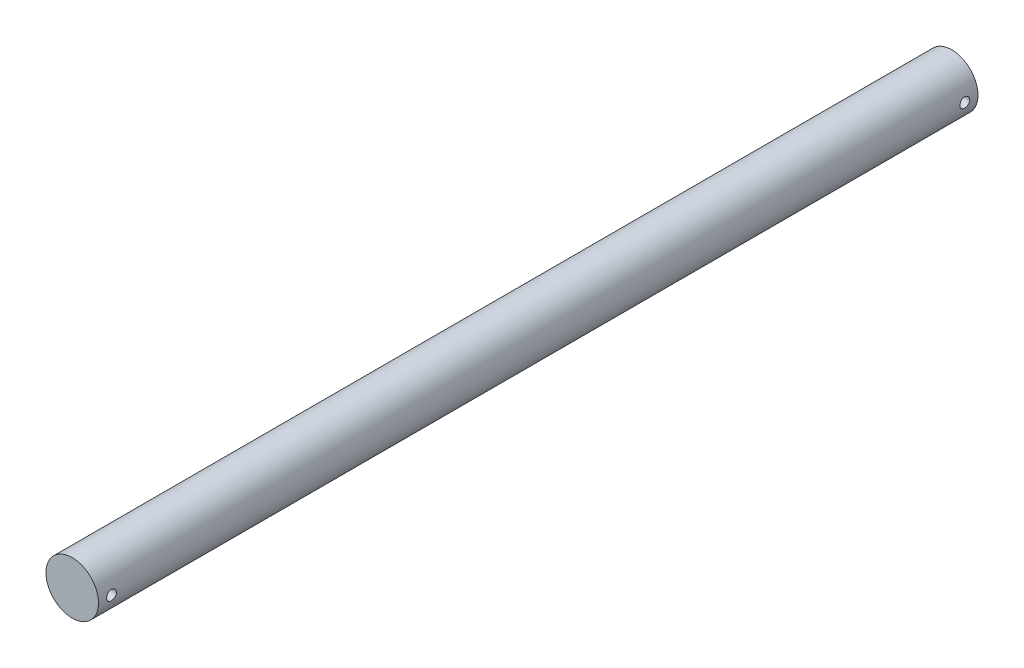
ISO-10303-21;
HEADER;
FILE_DESCRIPTION(('STEP AP214'),'2;1');
FILE_NAME('part.step','',(''),(''),'','','');
FILE_SCHEMA(('AUTOMOTIVE_DESIGN { 1 0 10303 214 1 1 1 1 }'));
ENDSEC;
DATA;
#1=APPLICATION_CONTEXT('core data for automotive mechanical design processes');
#2=APPLICATION_PROTOCOL_DEFINITION('international standard','automotive_design',2000,#1);
#3=PRODUCT_CONTEXT('',#1,'mechanical');
#4=PRODUCT('Part','Part','',(#3));
#5=PRODUCT_RELATED_PRODUCT_CATEGORY('part','',(#4));
#6=PRODUCT_DEFINITION_FORMATION('','',#4);
#7=PRODUCT_DEFINITION_CONTEXT('part definition',#1,'design');
#8=PRODUCT_DEFINITION('design','',#6,#7);
#9=PRODUCT_DEFINITION_SHAPE('','',#8);
#10=(LENGTH_UNIT() NAMED_UNIT(*) SI_UNIT(.MILLI.,.METRE.));
#11=(NAMED_UNIT(*) PLANE_ANGLE_UNIT() SI_UNIT($,.RADIAN.));
#12=(NAMED_UNIT(*) SI_UNIT($,.STERADIAN.) SOLID_ANGLE_UNIT());
#13=UNCERTAINTY_MEASURE_WITH_UNIT(LENGTH_MEASURE(1.E-05),#10,'distance_accuracy_value','');
#14=(GEOMETRIC_REPRESENTATION_CONTEXT(3) GLOBAL_UNCERTAINTY_ASSIGNED_CONTEXT((#13)) GLOBAL_UNIT_ASSIGNED_CONTEXT((#10,
#11,#12)) REPRESENTATION_CONTEXT('',''));
#15=CARTESIAN_POINT('',(0.,0.,0.));
#16=DIRECTION('',(0.,0.,1.));
#17=DIRECTION('',(1.,0.,0.));
#18=AXIS2_PLACEMENT_3D('',#15,#16,#17);
#19=CARTESIAN_POINT('',(0.,0.,50.));
#20=DIRECTION('',(0.,0.,-1.));
#21=DIRECTION('',(-1.,0.,0.));
#22=AXIS2_PLACEMENT_3D('',#19,#20,#21);
#23=CYLINDRICAL_SURFACE('',#22,3.175);
#24=CARTESIAN_POINT('',(-3.175,0.,52.1828125));
#25=CARTESIAN_POINT('',(-3.17499940005935,-0.0331278493784838,52.1828112341322));
#26=CARTESIAN_POINT('',(-3.1744761643768,-0.0662721689897577,52.1800379164667));
#27=CARTESIAN_POINT('',(-3.172439306503,-0.131626820280964,52.1690250644374));
#28=CARTESIAN_POINT('',(-3.17092484847487,-0.163836339741665,52.1607809167774));
#29=CARTESIAN_POINT('',(-3.16707495697541,-0.226366769234935,52.1390877091877));
#30=CARTESIAN_POINT('',(-3.1647402651001,-0.256689356240747,52.1256433498079));
#31=CARTESIAN_POINT('',(-3.15950485144289,-0.314645664321685,52.0939446957213));
#32=CARTESIAN_POINT('',(-3.15660417548509,-0.342279602808189,52.0756907903707));
#33=CARTESIAN_POINT('',(-3.15051811645856,-0.394407912259919,52.0346591545735));
#34=CARTESIAN_POINT('',(-3.14733001333614,-0.418865429028259,52.0118350016465));
#35=CARTESIAN_POINT('',(-3.14104860763277,-0.463627811849747,51.9624106242059));
#36=CARTESIAN_POINT('',(-3.13795531187578,-0.483932379579179,51.9358101286541));
#37=CARTESIAN_POINT('',(-3.13218731275362,-0.519965775954867,51.8793277086806));
#38=CARTESIAN_POINT('',(-3.12951611636078,-0.535657115316872,51.8494214780304));
#39=CARTESIAN_POINT('',(-3.12493308056007,-0.561778643443749,51.7873388992892));
#40=CARTESIAN_POINT('',(-3.12302117566919,-0.572209285923859,51.7551627472434));
#41=CARTESIAN_POINT('',(-3.120200569874,-0.587395056092017,51.6898480177308));
#42=CARTESIAN_POINT('',(-3.11928051754792,-0.592214454824656,51.6567248832974));
#43=CARTESIAN_POINT('',(-3.11851356370002,-0.596240425878407,51.5901283504042));
#44=CARTESIAN_POINT('',(-3.11866656594195,-0.595447501537267,51.5566549836238));
#45=CARTESIAN_POINT('',(-3.12001809916008,-0.588323450296877,51.49077381341));
#46=CARTESIAN_POINT('',(-3.12120283233473,-0.582065407796804,51.4583577821371));
#47=CARTESIAN_POINT('',(-3.12446266491102,-0.564303860103697,51.3950440333988));
#48=CARTESIAN_POINT('',(-3.12653780214714,-0.552800132013012,51.3641463805135));
#49=CARTESIAN_POINT('',(-3.13135905069246,-0.524802287242846,51.3045326180218));
#50=CARTESIAN_POINT('',(-3.13410911079898,-0.508278659956934,51.2758307007382));
#51=CARTESIAN_POINT('',(-3.13996773104908,-0.47073093294259,51.2215793733606));
#52=CARTESIAN_POINT('',(-3.1430763275616,-0.449706376466774,51.1960302836257));
#53=CARTESIAN_POINT('',(-3.1493618800489,-0.403359563188524,51.1483875957175));
#54=CARTESIAN_POINT('',(-3.15253914125162,-0.377974795254081,51.1263548035582));
#55=CARTESIAN_POINT('',(-3.15855900111739,-0.323837314723595,51.086851220107));
#56=CARTESIAN_POINT('',(-3.16140159642488,-0.295084568364007,51.0693804745546));
#57=CARTESIAN_POINT('',(-3.16643757934511,-0.234963886209632,51.0394879539328));
#58=CARTESIAN_POINT('',(-3.16863015282215,-0.2035927333897,51.0270725032876));
#59=CARTESIAN_POINT('',(-3.17211275581704,-0.139159898923854,51.007704481804));
#60=CARTESIAN_POINT('',(-3.17340288121048,-0.106098397260243,51.0007513306445));
#61=CARTESIAN_POINT('',(-3.17492205629786,-0.0397464966210276,50.9925899189396));
#62=CARTESIAN_POINT('',(-3.17516649268311,-0.00646668626416931,50.9912983446116));
#63=CARTESIAN_POINT('',(-3.17460925115547,0.0598333703365878,50.9942732684455));
#64=CARTESIAN_POINT('',(-3.17380762464009,0.0928536292531546,50.998539493529));
#65=CARTESIAN_POINT('',(-3.17125791126724,0.157432999370982,51.0124396483384));
#66=CARTESIAN_POINT('',(-3.16951726067193,0.189001503602659,51.0220314215072));
#67=CARTESIAN_POINT('',(-3.16528387378085,0.250082300755404,51.0462647773778));
#68=CARTESIAN_POINT('',(-3.16279108642311,0.279594453904933,51.0609067029402));
#69=CARTESIAN_POINT('',(-3.15729155798199,0.336080366506809,51.0950091321133));
#70=CARTESIAN_POINT('',(-3.1542794982553,0.363022863065379,51.1145205431068));
#71=CARTESIAN_POINT('',(-3.14808926947479,0.413281147045618,51.1577391982657));
#72=CARTESIAN_POINT('',(-3.14491108492985,0.436596595436344,51.1814468342224));
#73=CARTESIAN_POINT('',(-3.13869576292426,0.479255517992188,51.232762139068));
#74=CARTESIAN_POINT('',(-3.13566105888289,0.498542136242474,51.2604174166623));
#75=CARTESIAN_POINT('',(-3.1301252865148,0.532196179135591,51.3186241822329));
#76=CARTESIAN_POINT('',(-3.12762419835761,0.546563786592762,51.349175562522));
#77=CARTESIAN_POINT('',(-3.12345793983174,0.569891360504018,51.4121629535619));
#78=CARTESIAN_POINT('',(-3.12178874798386,0.57887738552931,51.4445890350126));
#79=CARTESIAN_POINT('',(-3.11946609009083,0.591267071075998,51.5105249914382));
#80=CARTESIAN_POINT('',(-3.1188125094486,0.594671361418124,51.5440347437008));
#81=CARTESIAN_POINT('',(-3.11860088672156,0.595779868526284,51.6106173065409));
#82=CARTESIAN_POINT('',(-3.11902560714798,0.593573770795138,51.6436886024423));
#83=CARTESIAN_POINT('',(-3.12088450886937,0.583720477284626,51.7089800331242));
#84=CARTESIAN_POINT('',(-3.12231868413374,0.576073314010788,51.7412001729884));
#85=CARTESIAN_POINT('',(-3.12602764121699,0.555592803846076,51.8038264361532));
#86=CARTESIAN_POINT('',(-3.12830084823627,0.542769168607846,51.8342358346904));
#87=CARTESIAN_POINT('',(-3.13343285059636,0.512309542245311,51.8924858384018));
#88=CARTESIAN_POINT('',(-3.13629168730422,0.494673211138111,51.9203262619103));
#89=CARTESIAN_POINT('',(-3.14232633736511,0.454777027878779,51.9730972730168));
#90=CARTESIAN_POINT('',(-3.14550625561989,0.432451906336454,51.9979780543626));
#91=CARTESIAN_POINT('',(-3.15179405961498,0.383947958425849,52.0436701738531));
#92=CARTESIAN_POINT('',(-3.15490192863971,0.357768247938239,52.0644805758265));
#93=CARTESIAN_POINT('',(-3.16072827962319,0.302015900075403,52.1016162218239));
#94=CARTESIAN_POINT('',(-3.16344300393129,0.272414837535456,52.1178993981822));
#95=CARTESIAN_POINT('',(-3.1681404894171,0.210855763856364,52.1452354370277));
#96=CARTESIAN_POINT('',(-3.17012393770743,0.178899999270518,52.1562932121092));
#97=CARTESIAN_POINT('',(-3.17273102874591,0.12237529612123,52.1706194341599));
#98=CARTESIAN_POINT('',(-3.17357708754788,0.0981367934437092,52.1751840189054));
#99=CARTESIAN_POINT('',(-3.17471178919248,0.0492685574488274,52.1812809840275));
#100=CARTESIAN_POINT('',(-3.17500044620579,0.0246388340934186,52.1828134414891));
#101=CARTESIAN_POINT('',(-3.175,0.,52.1828125));
#102=B_SPLINE_CURVE_WITH_KNOTS('',3,(#24,#25,#26,#27,#28,#29,#30,#31,#32,#33,#34,#35,#36,#37,
#38,#39,#40,#41,#42,#43,#44,#45,#46,#47,#48,#49,#50,#51,#52,#53,#54,#55,#56,#57,#58,#59,#60,#61,
#62,#63,#64,#65,#66,#67,#68,#69,#70,#71,#72,#73,#74,#75,#76,#77,#78,#79,#80,#81,#82,#83,#84,#85,
#86,#87,#88,#89,#90,#91,#92,#93,#94,#95,#96,#97,#98,#99,#100,#101),.UNSPECIFIED.,.T.,.F.,(4,2,2,
2,2,2,2,2,2,2,2,2,2,2,2,2,2,2,2,2,2,2,2,2,2,2,2,2,2,2,2,2,2,2,2,2,2,2,4),(0.,0.0992934422579541,
0.198670720631258,0.29795837951977,0.397238003055785,0.497582499616597,0.597934201813106,
0.699080193564165,0.800217460363043,0.900184538548674,1.00014265136193,1.09878415868192,
1.19742985782944,1.29666707356095,1.39591436451038,1.49672583109181,1.59753830838152,
1.69847652240175,1.79940401117393,1.89884119086451,1.99827348496882,2.0969296783217,
2.19559257087282,2.29533361900778,2.39508398463948,2.49615895304334,2.59723016460244,
2.69780792915491,2.79837434413148,2.89734328229475,2.99631162921161,3.09509515682429,
3.19388566460122,3.29415524955408,3.39444786907208,3.49564344413663,3.59674369125811,
3.67059505483126,3.74444454087568),.UNSPECIFIED.);
#103=CARTESIAN_POINT('',(-3.175,0.,52.1828125));
#104=VERTEX_POINT('',#103);
#105=EDGE_CURVE('E10',#104,#104,#102,.T.);
#106=ORIENTED_EDGE('',*,*,#105,.T.);
#107=EDGE_LOOP('',(#106));
#108=FACE_BOUND('',#107,.T.);
#109=CARTESIAN_POINT('',(3.175,0.,50.9921875));
#110=CARTESIAN_POINT('',(3.17499940005935,-0.0331278493784838,50.9921887658679));
#111=CARTESIAN_POINT('',(3.1744761643768,-0.0662721689897578,50.9949620835333));
#112=CARTESIAN_POINT('',(3.172439306503,-0.131626820280964,51.0059749355626));
#113=CARTESIAN_POINT('',(3.17092484847487,-0.163836339741665,51.0142190832226));
#114=CARTESIAN_POINT('',(3.16707495697541,-0.226366769234933,51.0359122908123));
#115=CARTESIAN_POINT('',(3.1647402651001,-0.256689356240744,51.0493566501921));
#116=CARTESIAN_POINT('',(3.15950485144289,-0.314645664321682,51.0810553042787));
#117=CARTESIAN_POINT('',(3.15660417548509,-0.342279602808187,51.0993092096294));
#118=CARTESIAN_POINT('',(3.15051811645856,-0.394407912259919,51.1403408454265));
#119=CARTESIAN_POINT('',(3.14733001333614,-0.418865429028259,51.1631649983535));
#120=CARTESIAN_POINT('',(3.14104860763277,-0.463627811849747,51.2125893757941));
#121=CARTESIAN_POINT('',(3.13795531187578,-0.483932379579179,51.2391898713459));
#122=CARTESIAN_POINT('',(3.13218731275362,-0.519965775954868,51.2956722913195));
#123=CARTESIAN_POINT('',(3.12951611636078,-0.535657115316874,51.3255785219697));
#124=CARTESIAN_POINT('',(3.12493308056007,-0.56177864344375,51.3876611007108));
#125=CARTESIAN_POINT('',(3.12302117566919,-0.572209285923859,51.4198372527566));
#126=CARTESIAN_POINT('',(3.120200569874,-0.587395056092017,51.4851519822692));
#127=CARTESIAN_POINT('',(3.11928051754792,-0.592214454824656,51.5182751167026));
#128=CARTESIAN_POINT('',(3.11851356370002,-0.596240425878407,51.5848716495958));
#129=CARTESIAN_POINT('',(3.11866656594195,-0.595447501537267,51.6183450163762));
#130=CARTESIAN_POINT('',(3.12001809916008,-0.588323450296877,51.68422618659));
#131=CARTESIAN_POINT('',(3.12120283233473,-0.582065407796804,51.7166422178629));
#132=CARTESIAN_POINT('',(3.12446266491102,-0.564303860103697,51.7799559666012));
#133=CARTESIAN_POINT('',(3.12653780214714,-0.552800132013012,51.8108536194865));
#134=CARTESIAN_POINT('',(3.13135905069246,-0.524802287242846,51.8704673819782));
#135=CARTESIAN_POINT('',(3.13410911079898,-0.508278659956934,51.8991692992618));
#136=CARTESIAN_POINT('',(3.13996773104908,-0.47073093294259,51.9534206266394));
#137=CARTESIAN_POINT('',(3.1430763275616,-0.449706376466774,51.9789697163743));
#138=CARTESIAN_POINT('',(3.1493618800489,-0.403359563188524,52.0266124042825));
#139=CARTESIAN_POINT('',(3.15253914125162,-0.377974795254081,52.0486451964418));
#140=CARTESIAN_POINT('',(3.15855900111739,-0.323837314723595,52.0881487798931));
#141=CARTESIAN_POINT('',(3.16140159642488,-0.295084568364007,52.1056195254454));
#142=CARTESIAN_POINT('',(3.16643757934511,-0.234963886209632,52.1355120460672));
#143=CARTESIAN_POINT('',(3.16863015282215,-0.2035927333897,52.1479274967124));
#144=CARTESIAN_POINT('',(3.17211275581704,-0.139159898923854,52.167295518196));
#145=CARTESIAN_POINT('',(3.17340288121048,-0.106098397260243,52.1742486693555));
#146=CARTESIAN_POINT('',(3.17492205629786,-0.0397464966210277,52.1824100810604));
#147=CARTESIAN_POINT('',(3.17516649268311,-0.00646668626416951,52.1837016553884));
#148=CARTESIAN_POINT('',(3.17460925115547,0.0598333703365875,52.1807267315545));
#149=CARTESIAN_POINT('',(3.17380762464009,0.0928536292531545,52.176460506471));
#150=CARTESIAN_POINT('',(3.17125791126724,0.157432999370982,52.1625603516616));
#151=CARTESIAN_POINT('',(3.16951726067193,0.189001503602659,52.1529685784928));
#152=CARTESIAN_POINT('',(3.16528387378085,0.250082300755404,52.1287352226222));
#153=CARTESIAN_POINT('',(3.16279108642311,0.279594453904933,52.1140932970598));
#154=CARTESIAN_POINT('',(3.15729155798199,0.336080366506809,52.0799908678867));
#155=CARTESIAN_POINT('',(3.1542794982553,0.363022863065379,52.0604794568932));
#156=CARTESIAN_POINT('',(3.14808926947479,0.413281147045618,52.0172608017343));
#157=CARTESIAN_POINT('',(3.14491108492985,0.436596595436344,51.9935531657776));
#158=CARTESIAN_POINT('',(3.13869576292426,0.479255517992188,51.942237860932));
#159=CARTESIAN_POINT('',(3.13566105888289,0.498542136242474,51.9145825833377));
#160=CARTESIAN_POINT('',(3.1301252865148,0.532196179135591,51.8563758177671));
#161=CARTESIAN_POINT('',(3.12762419835761,0.546563786592762,51.825824437478));
#162=CARTESIAN_POINT('',(3.12345793983174,0.569891360504017,51.7628370464381));
#163=CARTESIAN_POINT('',(3.12178874798386,0.578877385529308,51.7304109649874));
#164=CARTESIAN_POINT('',(3.11946609009083,0.591267071075998,51.6644750085618));
#165=CARTESIAN_POINT('',(3.1188125094486,0.594671361418124,51.6309652562993));
#166=CARTESIAN_POINT('',(3.11860088672156,0.595779868526284,51.5643826934592));
#167=CARTESIAN_POINT('',(3.11902560714798,0.593573770795138,51.5313113975577));
#168=CARTESIAN_POINT('',(3.12088450886937,0.583720477284626,51.4660199668758));
#169=CARTESIAN_POINT('',(3.12231868413374,0.576073314010788,51.4337998270116));
#170=CARTESIAN_POINT('',(3.12602764121699,0.555592803846076,51.3711735638468));
#171=CARTESIAN_POINT('',(3.12830084823627,0.542769168607846,51.3407641653096));
#172=CARTESIAN_POINT('',(3.13343285059636,0.512309542245311,51.2825141615982));
#173=CARTESIAN_POINT('',(3.13629168730422,0.494673211138111,51.2546737380897));
#174=CARTESIAN_POINT('',(3.14232633736511,0.454777027878779,51.2019027269832));
#175=CARTESIAN_POINT('',(3.14550625561989,0.432451906336454,51.1770219456374));
#176=CARTESIAN_POINT('',(3.15179405961498,0.383947958425849,51.1313298261469));
#177=CARTESIAN_POINT('',(3.15490192863971,0.357768247938239,51.1105194241735));
#178=CARTESIAN_POINT('',(3.16072827962319,0.302015900075403,51.0733837781761));
#179=CARTESIAN_POINT('',(3.16344300393129,0.272414837535456,51.0571006018178));
#180=CARTESIAN_POINT('',(3.1681404894171,0.210855763856364,51.0297645629723));
#181=CARTESIAN_POINT('',(3.17012393770743,0.178899999270518,51.0187067878908));
#182=CARTESIAN_POINT('',(3.17273102874591,0.12237529612123,51.0043805658401));
#183=CARTESIAN_POINT('',(3.17357708754788,0.0981367934437086,50.9998159810946));
#184=CARTESIAN_POINT('',(3.17471178919248,0.0492685574488269,50.9937190159725));
#185=CARTESIAN_POINT('',(3.17500044620579,0.0246388340934183,50.9921865585109));
#186=CARTESIAN_POINT('',(3.175,0.,50.9921875));
#187=B_SPLINE_CURVE_WITH_KNOTS('',3,(#109,#110,#111,#112,#113,#114,#115,#116,#117,#118,#119,
#120,#121,#122,#123,#124,#125,#126,#127,#128,#129,#130,#131,#132,#133,#134,#135,#136,#137,#138,
#139,#140,#141,#142,#143,#144,#145,#146,#147,#148,#149,#150,#151,#152,#153,#154,#155,#156,#157,
#158,#159,#160,#161,#162,#163,#164,#165,#166,#167,#168,#169,#170,#171,#172,#173,#174,#175,#176,
#177,#178,#179,#180,#181,#182,#183,#184,#185,#186),.UNSPECIFIED.,.T.,.F.,(4,2,2,2,2,2,2,2,2,2,2,
2,2,2,2,2,2,2,2,2,2,2,2,2,2,2,2,2,2,2,2,2,2,2,2,2,2,2,4),(0.,0.0992934422579541,
0.198670720631258,0.297958379519762,0.397238003055785,0.497582499616598,0.597934201813107,
0.699080193564173,0.800217460363044,0.900184538548674,1.00014265136193,1.09878415868192,
1.19742985782944,1.29666707356095,1.39591436451038,1.49672583109181,1.59753830838152,
1.69847652240175,1.79940401117393,1.89884119086451,1.99827348496882,2.0969296783217,
2.19559257087282,2.29533361900778,2.39508398463948,2.49615895304334,2.59723016460244,
2.69780792915491,2.79837434413148,2.89734328229475,2.99631162921161,3.09509515682429,
3.19388566460122,3.29415524955408,3.39444786907208,3.49564344413663,3.59674369125811,
3.67059505483126,3.74444454087568),.UNSPECIFIED.);
#188=CARTESIAN_POINT('',(3.175,0.,50.9921875));
#189=VERTEX_POINT('',#188);
#190=EDGE_CURVE('E49',#189,#189,#187,.T.);
#191=ORIENTED_EDGE('',*,*,#190,.T.);
#192=EDGE_LOOP('',(#191));
#193=FACE_BOUND('',#192,.T.);
#194=CARTESIAN_POINT('',(-3.175,0.,-50.9921875));
#195=CARTESIAN_POINT('',(-3.17499940005935,-0.0331278493784837,-50.9921887658678));
#196=CARTESIAN_POINT('',(-3.1744761643768,-0.0662721689897576,-50.9949620835333));
#197=CARTESIAN_POINT('',(-3.172439306503,-0.131626820280963,-51.0059749355626));
#198=CARTESIAN_POINT('',(-3.17092484847487,-0.163836339741665,-51.0142190832226));
#199=CARTESIAN_POINT('',(-3.16707495697541,-0.226366769234934,-51.0359122908123));
#200=CARTESIAN_POINT('',(-3.1647402651001,-0.256689356240746,-51.0493566501921));
#201=CARTESIAN_POINT('',(-3.15950485144289,-0.314645664321684,-51.0810553042787));
#202=CARTESIAN_POINT('',(-3.15660417548509,-0.342279602808188,-51.0993092096294));
#203=CARTESIAN_POINT('',(-3.15051811645856,-0.394407912259919,-51.1403408454265));
#204=CARTESIAN_POINT('',(-3.14733001333614,-0.418865429028258,-51.1631649983535));
#205=CARTESIAN_POINT('',(-3.14104860763277,-0.463627811849748,-51.2125893757941));
#206=CARTESIAN_POINT('',(-3.13795531187578,-0.483932379579179,-51.2391898713459));
#207=CARTESIAN_POINT('',(-3.13218731275362,-0.519965775954866,-51.2956722913194));
#208=CARTESIAN_POINT('',(-3.12951611636078,-0.535657115316869,-51.3255785219697));
#209=CARTESIAN_POINT('',(-3.12493308056007,-0.561778643443747,-51.3876611007108));
#210=CARTESIAN_POINT('',(-3.12302117566919,-0.572209285923858,-51.4198372527566));
#211=CARTESIAN_POINT('',(-3.120200569874,-0.587395056092017,-51.4851519822692));
#212=CARTESIAN_POINT('',(-3.11928051754792,-0.592214454824656,-51.5182751167026));
#213=CARTESIAN_POINT('',(-3.11851356370002,-0.596240425878407,-51.5848716495958));
#214=CARTESIAN_POINT('',(-3.11866656594195,-0.595447501537267,-51.6183450163762));
#215=CARTESIAN_POINT('',(-3.12001809916008,-0.588323450296877,-51.68422618659));
#216=CARTESIAN_POINT('',(-3.12120283233473,-0.582065407796804,-51.7166422178629));
#217=CARTESIAN_POINT('',(-3.12446266491102,-0.564303860103697,-51.7799559666012));
#218=CARTESIAN_POINT('',(-3.12653780214714,-0.552800132013012,-51.8108536194865));
#219=CARTESIAN_POINT('',(-3.13135905069246,-0.524802287242846,-51.8704673819782));
#220=CARTESIAN_POINT('',(-3.13410911079898,-0.508278659956934,-51.8991692992618));
#221=CARTESIAN_POINT('',(-3.13996773104908,-0.47073093294259,-51.9534206266394));
#222=CARTESIAN_POINT('',(-3.1430763275616,-0.449706376466774,-51.9789697163743));
#223=CARTESIAN_POINT('',(-3.1493618800489,-0.403359563188524,-52.0266124042825));
#224=CARTESIAN_POINT('',(-3.15253914125162,-0.377974795254081,-52.0486451964418));
#225=CARTESIAN_POINT('',(-3.15855900111739,-0.323837314723595,-52.0881487798931));
#226=CARTESIAN_POINT('',(-3.16140159642488,-0.295084568364007,-52.1056195254454));
#227=CARTESIAN_POINT('',(-3.16643757934511,-0.234963886209632,-52.1355120460672));
#228=CARTESIAN_POINT('',(-3.16863015282215,-0.2035927333897,-52.1479274967124));
#229=CARTESIAN_POINT('',(-3.17211275581704,-0.139159898923854,-52.167295518196));
#230=CARTESIAN_POINT('',(-3.17340288121048,-0.106098397260243,-52.1742486693555));
#231=CARTESIAN_POINT('',(-3.17492205629786,-0.0397464966210277,-52.1824100810604));
#232=CARTESIAN_POINT('',(-3.17516649268311,-0.00646668626416952,-52.1837016553884));
#233=CARTESIAN_POINT('',(-3.17460925115547,0.0598333703365875,-52.1807267315545));
#234=CARTESIAN_POINT('',(-3.17380762464009,0.0928536292531545,-52.176460506471));
#235=CARTESIAN_POINT('',(-3.17125791126724,0.157432999370982,-52.1625603516616));
#236=CARTESIAN_POINT('',(-3.16951726067193,0.189001503602659,-52.1529685784928));
#237=CARTESIAN_POINT('',(-3.16528387378085,0.250082300755404,-52.1287352226222));
#238=CARTESIAN_POINT('',(-3.16279108642311,0.279594453904933,-52.1140932970598));
#239=CARTESIAN_POINT('',(-3.15729155798199,0.336080366506809,-52.0799908678867));
#240=CARTESIAN_POINT('',(-3.1542794982553,0.363022863065379,-52.0604794568932));
#241=CARTESIAN_POINT('',(-3.14808926947479,0.413281147045618,-52.0172608017343));
#242=CARTESIAN_POINT('',(-3.14491108492985,0.436596595436344,-51.9935531657776));
#243=CARTESIAN_POINT('',(-3.13869576292426,0.479255517992188,-51.942237860932));
#244=CARTESIAN_POINT('',(-3.13566105888289,0.498542136242474,-51.9145825833377));
#245=CARTESIAN_POINT('',(-3.1301252865148,0.532196179135591,-51.8563758177671));
#246=CARTESIAN_POINT('',(-3.12762419835761,0.546563786592762,-51.825824437478));
#247=CARTESIAN_POINT('',(-3.12345793983174,0.569891360504017,-51.7628370464381));
#248=CARTESIAN_POINT('',(-3.12178874798386,0.578877385529308,-51.7304109649874));
#249=CARTESIAN_POINT('',(-3.11946609009083,0.591267071075998,-51.6644750085618));
#250=CARTESIAN_POINT('',(-3.1188125094486,0.594671361418124,-51.6309652562993));
#251=CARTESIAN_POINT('',(-3.11860088672156,0.595779868526284,-51.5643826934592));
#252=CARTESIAN_POINT('',(-3.11902560714798,0.593573770795138,-51.5313113975577));
#253=CARTESIAN_POINT('',(-3.12088450886937,0.583720477284626,-51.4660199668758));
#254=CARTESIAN_POINT('',(-3.12231868413374,0.576073314010788,-51.4337998270116));
#255=CARTESIAN_POINT('',(-3.12602764121699,0.555592803846076,-51.3711735638468));
#256=CARTESIAN_POINT('',(-3.12830084823627,0.542769168607846,-51.3407641653096));
#257=CARTESIAN_POINT('',(-3.13343285059636,0.512309542245311,-51.2825141615982));
#258=CARTESIAN_POINT('',(-3.13629168730422,0.494673211138111,-51.2546737380897));
#259=CARTESIAN_POINT('',(-3.14232633736511,0.454777027878779,-51.2019027269832));
#260=CARTESIAN_POINT('',(-3.14550625561989,0.432451906336454,-51.1770219456374));
#261=CARTESIAN_POINT('',(-3.15179405961498,0.383947958425849,-51.1313298261469));
#262=CARTESIAN_POINT('',(-3.15490192863971,0.357768247938239,-51.1105194241735));
#263=CARTESIAN_POINT('',(-3.16072827962319,0.302015900075403,-51.0733837781761));
#264=CARTESIAN_POINT('',(-3.16344300393129,0.272414837535456,-51.0571006018178));
#265=CARTESIAN_POINT('',(-3.1681404894171,0.210855763856364,-51.0297645629723));
#266=CARTESIAN_POINT('',(-3.17012393770743,0.178899999270518,-51.0187067878908));
#267=CARTESIAN_POINT('',(-3.17273102874591,0.12237529612123,-51.0043805658401));
#268=CARTESIAN_POINT('',(-3.17357708754788,0.0981367934437079,-50.9998159810946));
#269=CARTESIAN_POINT('',(-3.17471178919248,0.0492685574488262,-50.9937190159725));
#270=CARTESIAN_POINT('',(-3.17500044620579,0.024638834093418,-50.9921865585109));
#271=CARTESIAN_POINT('',(-3.175,0.,-50.9921875));
#272=B_SPLINE_CURVE_WITH_KNOTS('',3,(#194,#195,#196,#197,#198,#199,#200,#201,#202,#203,#204,
#205,#206,#207,#208,#209,#210,#211,#212,#213,#214,#215,#216,#217,#218,#219,#220,#221,#222,#223,
#224,#225,#226,#227,#228,#229,#230,#231,#232,#233,#234,#235,#236,#237,#238,#239,#240,#241,#242,
#243,#244,#245,#246,#247,#248,#249,#250,#251,#252,#253,#254,#255,#256,#257,#258,#259,#260,#261,
#262,#263,#264,#265,#266,#267,#268,#269,#270,#271),.UNSPECIFIED.,.T.,.F.,(4,2,2,2,2,2,2,2,2,2,2,
2,2,2,2,2,2,2,2,2,2,2,2,2,2,2,2,2,2,2,2,2,2,2,2,2,2,2,4),(0.,0.0992934422579546,
0.198670720631259,0.297958379519765,0.397238003055786,0.497582499616599,0.597934201813108,
0.699080193564165,0.800217460363044,0.900184538548674,1.00014265136193,1.09878415868192,
1.19742985782944,1.29666707356095,1.39591436451038,1.49672583109181,1.59753830838152,
1.69847652240175,1.79940401117393,1.89884119086451,1.99827348496882,2.0969296783217,
2.19559257087282,2.29533361900778,2.39508398463948,2.49615895304334,2.59723016460244,
2.69780792915491,2.79837434413148,2.89734328229475,2.99631162921161,3.09509515682429,
3.19388566460122,3.29415524955408,3.39444786907208,3.49564344413663,3.59674369125811,
3.67059505483126,3.74444454087569),.UNSPECIFIED.);
#273=CARTESIAN_POINT('',(-3.175,0.,-50.9921875));
#274=VERTEX_POINT('',#273);
#275=EDGE_CURVE('E54',#274,#274,#272,.T.);
#276=ORIENTED_EDGE('',*,*,#275,.T.);
#277=EDGE_LOOP('',(#276));
#278=FACE_BOUND('',#277,.T.);
#279=CARTESIAN_POINT('',(3.175,0.,-52.1828125));
#280=CARTESIAN_POINT('',(3.17499940005935,-0.0331278493784838,-52.1828112341322));
#281=CARTESIAN_POINT('',(3.1744761643768,-0.0662721689897577,-52.1800379164667));
#282=CARTESIAN_POINT('',(3.172439306503,-0.131626820280964,-52.1690250644374));
#283=CARTESIAN_POINT('',(3.17092484847487,-0.163836339741665,-52.1607809167774));
#284=CARTESIAN_POINT('',(3.16707495697541,-0.226366769234935,-52.1390877091877));
#285=CARTESIAN_POINT('',(3.1647402651001,-0.256689356240747,-52.1256433498079));
#286=CARTESIAN_POINT('',(3.15950485144289,-0.314645664321685,-52.0939446957213));
#287=CARTESIAN_POINT('',(3.15660417548509,-0.342279602808189,-52.0756907903707));
#288=CARTESIAN_POINT('',(3.15051811645856,-0.394407912259919,-52.0346591545735));
#289=CARTESIAN_POINT('',(3.14733001333614,-0.418865429028259,-52.0118350016465));
#290=CARTESIAN_POINT('',(3.14104860763277,-0.463627811849747,-51.9624106242059));
#291=CARTESIAN_POINT('',(3.13795531187578,-0.483932379579179,-51.9358101286541));
#292=CARTESIAN_POINT('',(3.13218731275362,-0.519965775954867,-51.8793277086806));
#293=CARTESIAN_POINT('',(3.12951611636078,-0.535657115316872,-51.8494214780304));
#294=CARTESIAN_POINT('',(3.12493308056007,-0.561778643443749,-51.7873388992892));
#295=CARTESIAN_POINT('',(3.12302117566919,-0.572209285923859,-51.7551627472434));
#296=CARTESIAN_POINT('',(3.120200569874,-0.587395056092017,-51.6898480177308));
#297=CARTESIAN_POINT('',(3.11928051754792,-0.592214454824656,-51.6567248832974));
#298=CARTESIAN_POINT('',(3.11851356370002,-0.596240425878407,-51.5901283504042));
#299=CARTESIAN_POINT('',(3.11866656594195,-0.595447501537267,-51.5566549836238));
#300=CARTESIAN_POINT('',(3.12001809916008,-0.588323450296877,-51.49077381341));
#301=CARTESIAN_POINT('',(3.12120283233473,-0.582065407796804,-51.4583577821371));
#302=CARTESIAN_POINT('',(3.12446266491102,-0.564303860103697,-51.3950440333988));
#303=CARTESIAN_POINT('',(3.12653780214714,-0.552800132013012,-51.3641463805135));
#304=CARTESIAN_POINT('',(3.13135905069246,-0.524802287242846,-51.3045326180218));
#305=CARTESIAN_POINT('',(3.13410911079898,-0.508278659956934,-51.2758307007382));
#306=CARTESIAN_POINT('',(3.13996773104908,-0.47073093294259,-51.2215793733606));
#307=CARTESIAN_POINT('',(3.1430763275616,-0.449706376466774,-51.1960302836257));
#308=CARTESIAN_POINT('',(3.1493618800489,-0.403359563188524,-51.1483875957175));
#309=CARTESIAN_POINT('',(3.15253914125162,-0.377974795254081,-51.1263548035582));
#310=CARTESIAN_POINT('',(3.15855900111739,-0.323837314723595,-51.086851220107));
#311=CARTESIAN_POINT('',(3.16140159642488,-0.295084568364007,-51.0693804745546));
#312=CARTESIAN_POINT('',(3.16643757934511,-0.234963886209632,-51.0394879539328));
#313=CARTESIAN_POINT('',(3.16863015282215,-0.2035927333897,-51.0270725032876));
#314=CARTESIAN_POINT('',(3.17211275581704,-0.139159898923854,-51.007704481804));
#315=CARTESIAN_POINT('',(3.17340288121048,-0.106098397260243,-51.0007513306445));
#316=CARTESIAN_POINT('',(3.17492205629786,-0.0397464966210276,-50.9925899189396));
#317=CARTESIAN_POINT('',(3.17516649268311,-0.00646668626416931,-50.9912983446116));
#318=CARTESIAN_POINT('',(3.17460925115547,0.0598333703365878,-50.9942732684455));
#319=CARTESIAN_POINT('',(3.17380762464009,0.0928536292531546,-50.998539493529));
#320=CARTESIAN_POINT('',(3.17125791126724,0.157432999370982,-51.0124396483384));
#321=CARTESIAN_POINT('',(3.16951726067193,0.189001503602659,-51.0220314215072));
#322=CARTESIAN_POINT('',(3.16528387378085,0.250082300755404,-51.0462647773778));
#323=CARTESIAN_POINT('',(3.16279108642311,0.279594453904933,-51.0609067029402));
#324=CARTESIAN_POINT('',(3.15729155798199,0.336080366506809,-51.0950091321133));
#325=CARTESIAN_POINT('',(3.1542794982553,0.363022863065379,-51.1145205431068));
#326=CARTESIAN_POINT('',(3.14808926947479,0.413281147045618,-51.1577391982657));
#327=CARTESIAN_POINT('',(3.14491108492985,0.436596595436344,-51.1814468342224));
#328=CARTESIAN_POINT('',(3.13869576292426,0.479255517992188,-51.232762139068));
#329=CARTESIAN_POINT('',(3.13566105888289,0.498542136242474,-51.2604174166623));
#330=CARTESIAN_POINT('',(3.1301252865148,0.532196179135591,-51.3186241822329));
#331=CARTESIAN_POINT('',(3.12762419835761,0.546563786592762,-51.349175562522));
#332=CARTESIAN_POINT('',(3.12345793983174,0.569891360504018,-51.4121629535619));
#333=CARTESIAN_POINT('',(3.12178874798386,0.57887738552931,-51.4445890350126));
#334=CARTESIAN_POINT('',(3.11946609009083,0.591267071075998,-51.5105249914382));
#335=CARTESIAN_POINT('',(3.1188125094486,0.594671361418124,-51.5440347437008));
#336=CARTESIAN_POINT('',(3.11860088672156,0.595779868526284,-51.6106173065409));
#337=CARTESIAN_POINT('',(3.11902560714798,0.593573770795138,-51.6436886024423));
#338=CARTESIAN_POINT('',(3.12088450886937,0.583720477284626,-51.7089800331242));
#339=CARTESIAN_POINT('',(3.12231868413374,0.576073314010788,-51.7412001729884));
#340=CARTESIAN_POINT('',(3.12602764121699,0.555592803846076,-51.8038264361532));
#341=CARTESIAN_POINT('',(3.12830084823627,0.542769168607846,-51.8342358346904));
#342=CARTESIAN_POINT('',(3.13343285059636,0.512309542245311,-51.8924858384018));
#343=CARTESIAN_POINT('',(3.13629168730422,0.494673211138111,-51.9203262619103));
#344=CARTESIAN_POINT('',(3.14232633736511,0.454777027878779,-51.9730972730168));
#345=CARTESIAN_POINT('',(3.14550625561989,0.432451906336454,-51.9979780543626));
#346=CARTESIAN_POINT('',(3.15179405961498,0.383947958425849,-52.0436701738531));
#347=CARTESIAN_POINT('',(3.15490192863971,0.357768247938239,-52.0644805758265));
#348=CARTESIAN_POINT('',(3.16072827962319,0.302015900075403,-52.1016162218239));
#349=CARTESIAN_POINT('',(3.16344300393129,0.272414837535456,-52.1178993981822));
#350=CARTESIAN_POINT('',(3.1681404894171,0.210855763856364,-52.1452354370277));
#351=CARTESIAN_POINT('',(3.17012393770743,0.178899999270518,-52.1562932121092));
#352=CARTESIAN_POINT('',(3.17273102874591,0.12237529612123,-52.1706194341599));
#353=CARTESIAN_POINT('',(3.17357708754788,0.0981367934437092,-52.1751840189054));
#354=CARTESIAN_POINT('',(3.17471178919248,0.0492685574488274,-52.1812809840275));
#355=CARTESIAN_POINT('',(3.17500044620579,0.0246388340934186,-52.1828134414891));
#356=CARTESIAN_POINT('',(3.175,0.,-52.1828125));
#357=B_SPLINE_CURVE_WITH_KNOTS('',3,(#279,#280,#281,#282,#283,#284,#285,#286,#287,#288,#289,
#290,#291,#292,#293,#294,#295,#296,#297,#298,#299,#300,#301,#302,#303,#304,#305,#306,#307,#308,
#309,#310,#311,#312,#313,#314,#315,#316,#317,#318,#319,#320,#321,#322,#323,#324,#325,#326,#327,
#328,#329,#330,#331,#332,#333,#334,#335,#336,#337,#338,#339,#340,#341,#342,#343,#344,#345,#346,
#347,#348,#349,#350,#351,#352,#353,#354,#355,#356),.UNSPECIFIED.,.T.,.F.,(4,2,2,2,2,2,2,2,2,2,2,
2,2,2,2,2,2,2,2,2,2,2,2,2,2,2,2,2,2,2,2,2,2,2,2,2,2,2,4),(0.,0.0992934422579541,
0.198670720631258,0.29795837951977,0.397238003055785,0.497582499616597,0.597934201813106,
0.699080193564165,0.800217460363043,0.900184538548674,1.00014265136193,1.09878415868192,
1.19742985782944,1.29666707356095,1.39591436451038,1.49672583109181,1.59753830838152,
1.69847652240175,1.79940401117393,1.89884119086451,1.99827348496882,2.0969296783217,
2.19559257087282,2.29533361900778,2.39508398463948,2.49615895304334,2.59723016460244,
2.69780792915491,2.79837434413148,2.89734328229475,2.99631162921161,3.09509515682429,
3.19388566460122,3.29415524955408,3.39444786907208,3.49564344413663,3.59674369125811,
3.67059505483126,3.74444454087568),.UNSPECIFIED.);
#358=CARTESIAN_POINT('',(3.175,0.,-52.1828125));
#359=VERTEX_POINT('',#358);
#360=EDGE_CURVE('E59',#359,#359,#357,.T.);
#361=ORIENTED_EDGE('',*,*,#360,.T.);
#362=EDGE_LOOP('',(#361));
#363=FACE_BOUND('',#362,.T.);
#364=CARTESIAN_POINT('',(0.,0.,53.175));
#365=DIRECTION('',(0.,0.,1.));
#366=DIRECTION('',(1.,0.,0.));
#367=AXIS2_PLACEMENT_3D('',#364,#365,#366);
#368=CIRCLE('',#367,3.175);
#369=CARTESIAN_POINT('',(3.175,0.,53.175));
#370=VERTEX_POINT('',#369);
#371=EDGE_CURVE('E87',#370,#370,#368,.T.);
#372=ORIENTED_EDGE('',*,*,#371,.F.);
#373=EDGE_LOOP('',(#372));
#374=FACE_BOUND('',#373,.T.);
#375=CARTESIAN_POINT('',(0.,0.,-53.175));
#376=DIRECTION('',(0.,0.,1.));
#377=DIRECTION('',(1.,0.,0.));
#378=AXIS2_PLACEMENT_3D('',#375,#376,#377);
#379=CIRCLE('',#378,3.175);
#380=CARTESIAN_POINT('',(3.175,0.,-53.175));
#381=VERTEX_POINT('',#380);
#382=EDGE_CURVE('E91',#381,#381,#379,.T.);
#383=ORIENTED_EDGE('',*,*,#382,.T.);
#384=EDGE_LOOP('',(#383));
#385=FACE_BOUND('',#384,.T.);
#386=ADVANCED_FACE('F37',(#108,#193,#278,#363,#374,#385),#23,.T.);
#387=CARTESIAN_POINT('',(0.,0.,53.175));
#388=DIRECTION('',(0.,0.,1.));
#389=DIRECTION('',(1.,0.,0.));
#390=AXIS2_PLACEMENT_3D('',#387,#388,#389);
#391=PLANE('',#390);
#392=ORIENTED_EDGE('',*,*,#371,.T.);
#393=EDGE_LOOP('',(#392));
#394=FACE_BOUND('',#393,.T.);
#395=ADVANCED_FACE('F98',(#394),#391,.T.);
#396=CARTESIAN_POINT('',(0.,0.,-53.175));
#397=DIRECTION('',(0.,0.,-1.));
#398=DIRECTION('',(1.,0.,0.));
#399=AXIS2_PLACEMENT_3D('',#396,#397,#398);
#400=PLANE('',#399);
#401=ORIENTED_EDGE('',*,*,#382,.F.);
#402=EDGE_LOOP('',(#401));
#403=FACE_BOUND('',#402,.T.);
#404=ADVANCED_FACE('F78',(#403),#400,.T.);
#405=CARTESIAN_POINT('',(-3.175,0.,-51.5875));
#406=DIRECTION('',(1.,0.,0.));
#407=DIRECTION('',(0.,0.,-1.));
#408=AXIS2_PLACEMENT_3D('',#405,#406,#407);
#409=CYLINDRICAL_SURFACE('',#408,0.595312500000001);
#410=ORIENTED_EDGE('',*,*,#360,.F.);
#411=EDGE_LOOP('',(#410));
#412=FACE_BOUND('',#411,.T.);
#413=ORIENTED_EDGE('',*,*,#275,.F.);
#414=EDGE_LOOP('',(#413));
#415=FACE_BOUND('',#414,.T.);
#416=ADVANCED_FACE('F72',(#412,#415),#409,.F.);
#417=CARTESIAN_POINT('',(-3.175,0.,51.5875));
#418=DIRECTION('',(1.,0.,0.));
#419=DIRECTION('',(0.,0.,-1.));
#420=AXIS2_PLACEMENT_3D('',#417,#418,#419);
#421=CYLINDRICAL_SURFACE('',#420,0.595312500000001);
#422=ORIENTED_EDGE('',*,*,#190,.F.);
#423=EDGE_LOOP('',(#422));
#424=FACE_BOUND('',#423,.T.);
#425=ORIENTED_EDGE('',*,*,#105,.F.);
#426=EDGE_LOOP('',(#425));
#427=FACE_BOUND('',#426,.T.);
#428=ADVANCED_FACE('F69',(#424,#427),#421,.F.);
#429=CLOSED_SHELL('',(#386,#395,#404,#416,#428));
#430=MANIFOLD_SOLID_BREP('B2',#429);
#431=ADVANCED_BREP_SHAPE_REPRESENTATION('',(#18,#430),#14);
#432=SHAPE_DEFINITION_REPRESENTATION(#9,#431);
ENDSEC;
END-ISO-10303-21;
